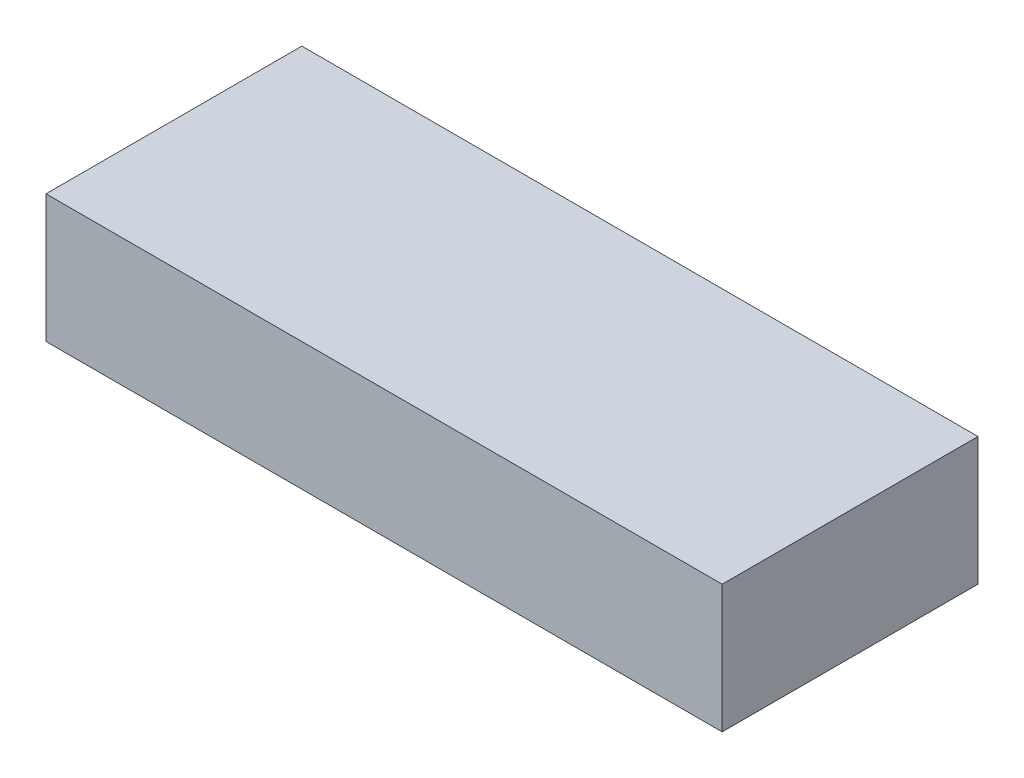
ISO-10303-21;
HEADER;
FILE_DESCRIPTION(('STEP AP214'),'2;1');
FILE_NAME('part.step','',(''),(''),'','','');
FILE_SCHEMA(('AUTOMOTIVE_DESIGN { 1 0 10303 214 1 1 1 1 }'));
ENDSEC;
DATA;
#1=APPLICATION_CONTEXT('core data for automotive mechanical design processes');
#2=APPLICATION_PROTOCOL_DEFINITION('international standard','automotive_design',2000,#1);
#3=PRODUCT_CONTEXT('',#1,'mechanical');
#4=PRODUCT('Part','Part','',(#3));
#5=PRODUCT_RELATED_PRODUCT_CATEGORY('part','',(#4));
#6=PRODUCT_DEFINITION_FORMATION('','',#4);
#7=PRODUCT_DEFINITION_CONTEXT('part definition',#1,'design');
#8=PRODUCT_DEFINITION('design','',#6,#7);
#9=PRODUCT_DEFINITION_SHAPE('','',#8);
#10=(LENGTH_UNIT() NAMED_UNIT(*) SI_UNIT(.MILLI.,.METRE.));
#11=(NAMED_UNIT(*) PLANE_ANGLE_UNIT() SI_UNIT($,.RADIAN.));
#12=(NAMED_UNIT(*) SI_UNIT($,.STERADIAN.) SOLID_ANGLE_UNIT());
#13=UNCERTAINTY_MEASURE_WITH_UNIT(LENGTH_MEASURE(1.E-05),#10,'distance_accuracy_value','');
#14=(GEOMETRIC_REPRESENTATION_CONTEXT(3) GLOBAL_UNCERTAINTY_ASSIGNED_CONTEXT((#13)) GLOBAL_UNIT_ASSIGNED_CONTEXT((#10,
#11,#12)) REPRESENTATION_CONTEXT('',''));
#15=CARTESIAN_POINT('',(0.,0.,0.));
#16=DIRECTION('',(0.,0.,1.));
#17=DIRECTION('',(1.,0.,0.));
#18=AXIS2_PLACEMENT_3D('',#15,#16,#17);
#19=CARTESIAN_POINT('',(185.,35.,-70.));
#20=DIRECTION('',(-1.,0.,0.));
#21=DIRECTION('',(0.,0.,1.));
#22=AXIS2_PLACEMENT_3D('',#19,#20,#21);
#23=PLANE('',#22);
#24=DIRECTION('',(0.,0.,-1.));
#25=VECTOR('',#24,1.);
#26=CARTESIAN_POINT('',(185.,-35.,-70.));
#27=LINE('',#26,#25);
#28=CARTESIAN_POINT('',(185.,-35.,70.));
#29=VERTEX_POINT('',#28);
#30=CARTESIAN_POINT('',(185.,-35.,-70.));
#31=VERTEX_POINT('',#30);
#32=EDGE_CURVE('E95',#29,#31,#27,.T.);
#33=ORIENTED_EDGE('',*,*,#32,.T.);
#34=DIRECTION('',(0.,-1.,0.));
#35=VECTOR('',#34,1.);
#36=CARTESIAN_POINT('',(185.,35.,-70.));
#37=LINE('',#36,#35);
#38=CARTESIAN_POINT('',(185.,35.,-70.));
#39=VERTEX_POINT('',#38);
#40=EDGE_CURVE('E11',#39,#31,#37,.T.);
#41=ORIENTED_EDGE('',*,*,#40,.F.);
#42=DIRECTION('',(0.,0.,-1.));
#43=VECTOR('',#42,1.);
#44=CARTESIAN_POINT('',(185.,35.,-70.));
#45=LINE('',#44,#43);
#46=CARTESIAN_POINT('',(185.,35.,70.));
#47=VERTEX_POINT('',#46);
#48=EDGE_CURVE('E83',#47,#39,#45,.T.);
#49=ORIENTED_EDGE('',*,*,#48,.F.);
#50=DIRECTION('',(0.,-1.,0.));
#51=VECTOR('',#50,1.);
#52=CARTESIAN_POINT('',(185.,35.,70.));
#53=LINE('',#52,#51);
#54=EDGE_CURVE('E91',#47,#29,#53,.T.);
#55=ORIENTED_EDGE('',*,*,#54,.T.);
#56=EDGE_LOOP('',(#33,#41,#49,#55));
#57=FACE_BOUND('',#56,.T.);
#58=ADVANCED_FACE('F32',(#57),#23,.F.);
#59=CARTESIAN_POINT('',(-185.,35.,-70.));
#60=DIRECTION('',(0.,0.,1.));
#61=DIRECTION('',(1.,0.,0.));
#62=AXIS2_PLACEMENT_3D('',#59,#60,#61);
#63=PLANE('',#62);
#64=DIRECTION('',(-1.,0.,0.));
#65=VECTOR('',#64,1.);
#66=CARTESIAN_POINT('',(-185.,-35.,-70.));
#67=LINE('',#66,#65);
#68=CARTESIAN_POINT('',(-185.,-35.,-70.));
#69=VERTEX_POINT('',#68);
#70=EDGE_CURVE('E87',#31,#69,#67,.T.);
#71=ORIENTED_EDGE('',*,*,#70,.T.);
#72=DIRECTION('',(0.,-1.,0.));
#73=VECTOR('',#72,1.);
#74=CARTESIAN_POINT('',(-185.,35.,-70.));
#75=LINE('',#74,#73);
#76=CARTESIAN_POINT('',(-185.,35.,-70.));
#77=VERTEX_POINT('',#76);
#78=EDGE_CURVE('E40',#77,#69,#75,.T.);
#79=ORIENTED_EDGE('',*,*,#78,.F.);
#80=DIRECTION('',(-1.,0.,0.));
#81=VECTOR('',#80,1.);
#82=CARTESIAN_POINT('',(-185.,35.,-70.));
#83=LINE('',#82,#81);
#84=EDGE_CURVE('E78',#39,#77,#83,.T.);
#85=ORIENTED_EDGE('',*,*,#84,.F.);
#86=ORIENTED_EDGE('',*,*,#40,.T.);
#87=EDGE_LOOP('',(#71,#79,#85,#86));
#88=FACE_BOUND('',#87,.T.);
#89=ADVANCED_FACE('F86',(#88),#63,.F.);
#90=CARTESIAN_POINT('',(-185.,35.,-70.));
#91=DIRECTION('',(1.,0.,0.));
#92=DIRECTION('',(0.,0.,-1.));
#93=AXIS2_PLACEMENT_3D('',#90,#91,#92);
#94=PLANE('',#93);
#95=DIRECTION('',(0.,0.,1.));
#96=VECTOR('',#95,1.);
#97=CARTESIAN_POINT('',(-185.,-35.,-70.));
#98=LINE('',#97,#96);
#99=CARTESIAN_POINT('',(-185.,-35.,70.));
#100=VERTEX_POINT('',#99);
#101=EDGE_CURVE('E65',#69,#100,#98,.T.);
#102=ORIENTED_EDGE('',*,*,#101,.T.);
#103=DIRECTION('',(0.,-1.,0.));
#104=VECTOR('',#103,1.);
#105=CARTESIAN_POINT('',(-185.,35.,70.));
#106=LINE('',#105,#104);
#107=CARTESIAN_POINT('',(-185.,35.,70.));
#108=VERTEX_POINT('',#107);
#109=EDGE_CURVE('E88',#108,#100,#106,.T.);
#110=ORIENTED_EDGE('',*,*,#109,.F.);
#111=DIRECTION('',(0.,0.,1.));
#112=VECTOR('',#111,1.);
#113=CARTESIAN_POINT('',(-185.,35.,-70.));
#114=LINE('',#113,#112);
#115=EDGE_CURVE('E81',#77,#108,#114,.T.);
#116=ORIENTED_EDGE('',*,*,#115,.F.);
#117=ORIENTED_EDGE('',*,*,#78,.T.);
#118=EDGE_LOOP('',(#102,#110,#116,#117));
#119=FACE_BOUND('',#118,.T.);
#120=ADVANCED_FACE('F89',(#119),#94,.F.);
#121=CARTESIAN_POINT('',(-185.,35.,70.));
#122=DIRECTION('',(0.,0.,-1.));
#123=DIRECTION('',(-1.,0.,0.));
#124=AXIS2_PLACEMENT_3D('',#121,#122,#123);
#125=PLANE('',#124);
#126=DIRECTION('',(1.,0.,0.));
#127=VECTOR('',#126,1.);
#128=CARTESIAN_POINT('',(-185.,-35.,70.));
#129=LINE('',#128,#127);
#130=EDGE_CURVE('E71',#100,#29,#129,.T.);
#131=ORIENTED_EDGE('',*,*,#130,.T.);
#132=ORIENTED_EDGE('',*,*,#54,.F.);
#133=DIRECTION('',(1.,0.,0.));
#134=VECTOR('',#133,1.);
#135=CARTESIAN_POINT('',(-185.,35.,70.));
#136=LINE('',#135,#134);
#137=EDGE_CURVE('E48',#108,#47,#136,.T.);
#138=ORIENTED_EDGE('',*,*,#137,.F.);
#139=ORIENTED_EDGE('',*,*,#109,.T.);
#140=EDGE_LOOP('',(#131,#132,#138,#139));
#141=FACE_BOUND('',#140,.T.);
#142=ADVANCED_FACE('F102',(#141),#125,.F.);
#143=CARTESIAN_POINT('',(0.,35.,0.));
#144=DIRECTION('',(0.,1.,0.));
#145=DIRECTION('',(0.,0.,1.));
#146=AXIS2_PLACEMENT_3D('',#143,#144,#145);
#147=PLANE('',#146);
#148=ORIENTED_EDGE('',*,*,#48,.T.);
#149=ORIENTED_EDGE('',*,*,#84,.T.);
#150=ORIENTED_EDGE('',*,*,#115,.T.);
#151=ORIENTED_EDGE('',*,*,#137,.T.);
#152=EDGE_LOOP('',(#148,#149,#150,#151));
#153=FACE_BOUND('',#152,.T.);
#154=ADVANCED_FACE('F79',(#153),#147,.T.);
#155=CARTESIAN_POINT('',(0.,-35.,0.));
#156=DIRECTION('',(0.,1.,0.));
#157=DIRECTION('',(0.,0.,1.));
#158=AXIS2_PLACEMENT_3D('',#155,#156,#157);
#159=PLANE('',#158);
#160=ORIENTED_EDGE('',*,*,#32,.F.);
#161=ORIENTED_EDGE('',*,*,#130,.F.);
#162=ORIENTED_EDGE('',*,*,#101,.F.);
#163=ORIENTED_EDGE('',*,*,#70,.F.);
#164=EDGE_LOOP('',(#160,#161,#162,#163));
#165=FACE_BOUND('',#164,.T.);
#166=ADVANCED_FACE('F105',(#165),#159,.F.);
#167=CLOSED_SHELL('',(#58,#89,#120,#142,#154,#166));
#168=MANIFOLD_SOLID_BREP('B2',#167);
#169=ADVANCED_BREP_SHAPE_REPRESENTATION('',(#18,#168),#14);
#170=SHAPE_DEFINITION_REPRESENTATION(#9,#169);
ENDSEC;
END-ISO-10303-21;
